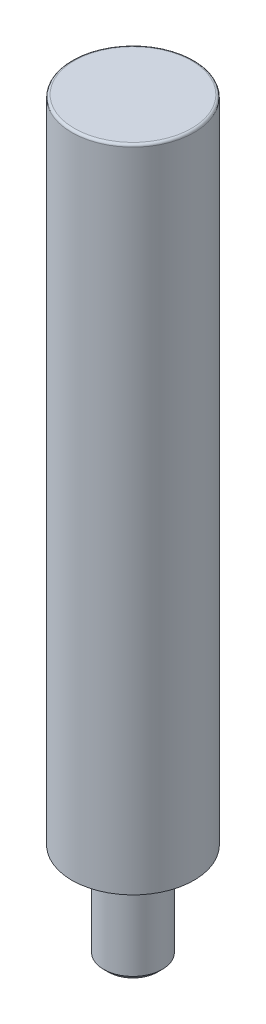
ISO-10303-21;
HEADER;
FILE_DESCRIPTION(('STEP AP214'),'2;1');
FILE_NAME('part.step','',(''),(''),'','','');
FILE_SCHEMA(('AUTOMOTIVE_DESIGN { 1 0 10303 214 1 1 1 1 }'));
ENDSEC;
DATA;
#1=APPLICATION_CONTEXT('core data for automotive mechanical design processes');
#2=APPLICATION_PROTOCOL_DEFINITION('international standard','automotive_design',2000,#1);
#3=PRODUCT_CONTEXT('',#1,'mechanical');
#4=PRODUCT('Part','Part','',(#3));
#5=PRODUCT_RELATED_PRODUCT_CATEGORY('part','',(#4));
#6=PRODUCT_DEFINITION_FORMATION('','',#4);
#7=PRODUCT_DEFINITION_CONTEXT('part definition',#1,'design');
#8=PRODUCT_DEFINITION('design','',#6,#7);
#9=PRODUCT_DEFINITION_SHAPE('','',#8);
#10=(LENGTH_UNIT() NAMED_UNIT(*) SI_UNIT(.MILLI.,.METRE.));
#11=(NAMED_UNIT(*) PLANE_ANGLE_UNIT() SI_UNIT($,.RADIAN.));
#12=(NAMED_UNIT(*) SI_UNIT($,.STERADIAN.) SOLID_ANGLE_UNIT());
#13=UNCERTAINTY_MEASURE_WITH_UNIT(LENGTH_MEASURE(1.E-05),#10,'distance_accuracy_value','');
#14=(GEOMETRIC_REPRESENTATION_CONTEXT(3) GLOBAL_UNCERTAINTY_ASSIGNED_CONTEXT((#13)) GLOBAL_UNIT_ASSIGNED_CONTEXT((#10,
#11,#12)) REPRESENTATION_CONTEXT('',''));
#15=CARTESIAN_POINT('',(0.,0.,0.));
#16=DIRECTION('',(0.,0.,1.));
#17=DIRECTION('',(1.,0.,0.));
#18=AXIS2_PLACEMENT_3D('',#15,#16,#17);
#19=CARTESIAN_POINT('',(0.,133.,0.));
#20=DIRECTION('',(0.,-1.,0.));
#21=DIRECTION('',(0.,0.,-1.));
#22=AXIS2_PLACEMENT_3D('',#19,#20,#21);
#23=CYLINDRICAL_SURFACE('',#22,12.5);
#24=CARTESIAN_POINT('',(0.,132.5,0.));
#25=DIRECTION('',(0.,1.,0.));
#26=DIRECTION('',(0.,0.,1.));
#27=AXIS2_PLACEMENT_3D('',#24,#25,#26);
#28=CIRCLE('',#27,12.5);
#29=CARTESIAN_POINT('',(0.,132.5,12.5));
#30=VERTEX_POINT('',#29);
#31=EDGE_CURVE('E10',#30,#30,#28,.F.);
#32=ORIENTED_EDGE('',*,*,#31,.T.);
#33=EDGE_LOOP('',(#32));
#34=FACE_BOUND('',#33,.T.);
#35=CARTESIAN_POINT('',(0.,0.,0.));
#36=DIRECTION('',(0.,1.,0.));
#37=DIRECTION('',(0.,0.,1.));
#38=AXIS2_PLACEMENT_3D('',#35,#36,#37);
#39=CIRCLE('',#38,12.5);
#40=CARTESIAN_POINT('',(0.,0.,12.5));
#41=VERTEX_POINT('',#40);
#42=EDGE_CURVE('E54',#41,#41,#39,.T.);
#43=ORIENTED_EDGE('',*,*,#42,.T.);
#44=EDGE_LOOP('',(#43));
#45=FACE_BOUND('',#44,.T.);
#46=ADVANCED_FACE('F41',(#34,#45),#23,.T.);
#47=CARTESIAN_POINT('',(0.,133.,0.));
#48=DIRECTION('',(0.,1.,0.));
#49=DIRECTION('',(0.,0.,1.));
#50=AXIS2_PLACEMENT_3D('',#47,#48,#49);
#51=PLANE('',#50);
#52=CARTESIAN_POINT('',(0.,133.,0.));
#53=DIRECTION('',(0.,1.,0.));
#54=DIRECTION('',(0.,0.,1.));
#55=AXIS2_PLACEMENT_3D('',#52,#53,#54);
#56=CIRCLE('',#55,12.);
#57=CARTESIAN_POINT('',(0.,133.,12.));
#58=VERTEX_POINT('',#57);
#59=EDGE_CURVE('E49',#58,#58,#56,.T.);
#60=ORIENTED_EDGE('',*,*,#59,.T.);
#61=EDGE_LOOP('',(#60));
#62=FACE_BOUND('',#61,.T.);
#63=ADVANCED_FACE('F92',(#62),#51,.T.);
#64=CARTESIAN_POINT('',(0.,0.,0.));
#65=DIRECTION('',(0.,1.,0.));
#66=DIRECTION('',(0.,0.,1.));
#67=AXIS2_PLACEMENT_3D('',#64,#65,#66);
#68=PLANE('',#67);
#69=ORIENTED_EDGE('',*,*,#42,.F.);
#70=EDGE_LOOP('',(#69));
#71=FACE_BOUND('',#70,.T.);
#72=CARTESIAN_POINT('',(0.,0.,0.));
#73=DIRECTION('',(0.,1.,0.));
#74=DIRECTION('',(0.,0.,1.));
#75=AXIS2_PLACEMENT_3D('',#72,#73,#74);
#76=CIRCLE('',#75,6.);
#77=CARTESIAN_POINT('',(0.,0.,6.));
#78=VERTEX_POINT('',#77);
#79=EDGE_CURVE('E59',#78,#78,#76,.T.);
#80=ORIENTED_EDGE('',*,*,#79,.T.);
#81=EDGE_LOOP('',(#80));
#82=FACE_BOUND('',#81,.T.);
#83=ADVANCED_FACE('F96',(#71,#82),#68,.F.);
#84=CARTESIAN_POINT('',(0.,-20.,0.));
#85=DIRECTION('',(0.,1.,0.));
#86=DIRECTION('',(0.,0.,1.));
#87=AXIS2_PLACEMENT_3D('',#84,#85,#86);
#88=CYLINDRICAL_SURFACE('',#87,6.);
#89=ORIENTED_EDGE('',*,*,#79,.F.);
#90=EDGE_LOOP('',(#89));
#91=FACE_BOUND('',#90,.T.);
#92=CARTESIAN_POINT('',(0.,-19.036,0.));
#93=DIRECTION('',(0.,1.,0.));
#94=DIRECTION('',(0.,0.,1.));
#95=AXIS2_PLACEMENT_3D('',#92,#93,#94);
#96=CIRCLE('',#95,6.);
#97=CARTESIAN_POINT('',(0.,-19.036,6.));
#98=VERTEX_POINT('',#97);
#99=EDGE_CURVE('E69',#98,#98,#96,.T.);
#100=ORIENTED_EDGE('',*,*,#99,.T.);
#101=EDGE_LOOP('',(#100));
#102=FACE_BOUND('',#101,.T.);
#103=ADVANCED_FACE('F74',(#91,#102),#88,.T.);
#104=CARTESIAN_POINT('',(0.,-20.,0.));
#105=DIRECTION('',(0.,1.,0.));
#106=DIRECTION('',(0.,0.,1.));
#107=AXIS2_PLACEMENT_3D('',#104,#105,#106);
#108=CONICAL_SURFACE('',#107,5.036,0.785398163397449);
#109=ORIENTED_EDGE('',*,*,#99,.F.);
#110=EDGE_LOOP('',(#109));
#111=FACE_BOUND('',#110,.T.);
#112=CARTESIAN_POINT('',(0.,-20.,0.));
#113=DIRECTION('',(0.,1.,0.));
#114=DIRECTION('',(0.,0.,1.));
#115=AXIS2_PLACEMENT_3D('',#112,#113,#114);
#116=CIRCLE('',#115,5.036);
#117=CARTESIAN_POINT('',(0.,-20.,5.036));
#118=VERTEX_POINT('',#117);
#119=EDGE_CURVE('E65',#118,#118,#116,.T.);
#120=ORIENTED_EDGE('',*,*,#119,.T.);
#121=EDGE_LOOP('',(#120));
#122=FACE_BOUND('',#121,.T.);
#123=ADVANCED_FACE('F76',(#111,#122),#108,.T.);
#124=CARTESIAN_POINT('',(0.,-20.,0.));
#125=DIRECTION('',(0.,-1.,0.));
#126=DIRECTION('',(0.,0.,-1.));
#127=AXIS2_PLACEMENT_3D('',#124,#125,#126);
#128=PLANE('',#127);
#129=ORIENTED_EDGE('',*,*,#119,.F.);
#130=EDGE_LOOP('',(#129));
#131=FACE_BOUND('',#130,.T.);
#132=ADVANCED_FACE('F79',(#131),#128,.T.);
#133=CARTESIAN_POINT('',(0.,132.5,0.));
#134=DIRECTION('',(0.,1.,0.));
#135=DIRECTION('',(0.,0.,1.));
#136=AXIS2_PLACEMENT_3D('',#133,#134,#135);
#137=TOROIDAL_SURFACE('',#136,12.,0.5);
#138=ORIENTED_EDGE('',*,*,#31,.F.);
#139=EDGE_LOOP('',(#138));
#140=FACE_BOUND('',#139,.T.);
#141=ORIENTED_EDGE('',*,*,#59,.F.);
#142=EDGE_LOOP('',(#141));
#143=FACE_BOUND('',#142,.T.);
#144=ADVANCED_FACE('F43',(#140,#143),#137,.T.);
#145=CLOSED_SHELL('',(#46,#63,#83,#103,#123,#132,#144));
#146=MANIFOLD_SOLID_BREP('B2',#145);
#147=ADVANCED_BREP_SHAPE_REPRESENTATION('',(#18,#146),#14);
#148=SHAPE_DEFINITION_REPRESENTATION(#9,#147);
ENDSEC;
END-ISO-10303-21;
